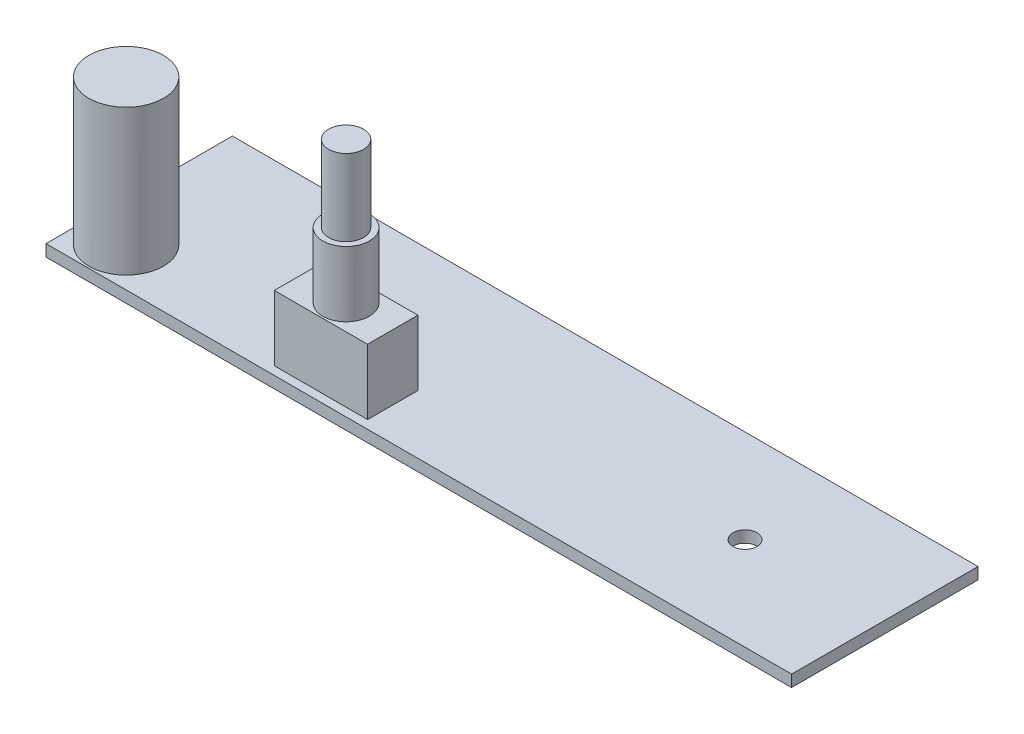
ISO-10303-21;
HEADER;
FILE_DESCRIPTION(('STEP AP214'),'2;1');
FILE_NAME('part.step','',(''),(''),'','','');
FILE_SCHEMA(('AUTOMOTIVE_DESIGN { 1 0 10303 214 1 1 1 1 }'));
ENDSEC;
DATA;
#1=APPLICATION_CONTEXT('core data for automotive mechanical design processes');
#2=APPLICATION_PROTOCOL_DEFINITION('international standard','automotive_design',2000,#1);
#3=PRODUCT_CONTEXT('',#1,'mechanical');
#4=PRODUCT('Part','Part','',(#3));
#5=PRODUCT_RELATED_PRODUCT_CATEGORY('part','',(#4));
#6=PRODUCT_DEFINITION_FORMATION('','',#4);
#7=PRODUCT_DEFINITION_CONTEXT('part definition',#1,'design');
#8=PRODUCT_DEFINITION('design','',#6,#7);
#9=PRODUCT_DEFINITION_SHAPE('','',#8);
#10=(LENGTH_UNIT() NAMED_UNIT(*) SI_UNIT(.MILLI.,.METRE.));
#11=(NAMED_UNIT(*) PLANE_ANGLE_UNIT() SI_UNIT($,.RADIAN.));
#12=(NAMED_UNIT(*) SI_UNIT($,.STERADIAN.) SOLID_ANGLE_UNIT());
#13=UNCERTAINTY_MEASURE_WITH_UNIT(LENGTH_MEASURE(1.E-05),#10,'distance_accuracy_value','');
#14=(GEOMETRIC_REPRESENTATION_CONTEXT(3) GLOBAL_UNCERTAINTY_ASSIGNED_CONTEXT((#13)) GLOBAL_UNIT_ASSIGNED_CONTEXT((#10,
#11,#12)) REPRESENTATION_CONTEXT('',''));
#15=CARTESIAN_POINT('',(0.,0.,0.));
#16=DIRECTION('',(0.,0.,1.));
#17=DIRECTION('',(1.,0.,0.));
#18=AXIS2_PLACEMENT_3D('',#15,#16,#17);
#19=CARTESIAN_POINT('',(0.,1.5875,0.));
#20=DIRECTION('',(0.,-1.,0.));
#21=DIRECTION('',(0.,0.,-1.));
#22=AXIS2_PLACEMENT_3D('',#19,#20,#21);
#23=PLANE('',#22);
#24=DIRECTION('',(0.,0.,1.));
#25=VECTOR('',#24,1.);
#26=CARTESIAN_POINT('',(0.,1.5875,0.));
#27=LINE('',#26,#25);
#28=CARTESIAN_POINT('',(0.,1.5875,-25.4));
#29=VERTEX_POINT('',#28);
#30=CARTESIAN_POINT('',(0.,1.5875,0.));
#31=VERTEX_POINT('',#30);
#32=EDGE_CURVE('E140',#29,#31,#27,.T.);
#33=ORIENTED_EDGE('',*,*,#32,.T.);
#34=DIRECTION('',(1.,0.,0.));
#35=VECTOR('',#34,1.);
#36=CARTESIAN_POINT('',(0.,1.5875,0.));
#37=LINE('',#36,#35);
#38=CARTESIAN_POINT('',(101.6,1.5875,0.));
#39=VERTEX_POINT('',#38);
#40=EDGE_CURVE('E143',#31,#39,#37,.T.);
#41=ORIENTED_EDGE('',*,*,#40,.T.);
#42=DIRECTION('',(0.,0.,-1.));
#43=VECTOR('',#42,1.);
#44=CARTESIAN_POINT('',(101.6,1.5875,0.));
#45=LINE('',#44,#43);
#46=CARTESIAN_POINT('',(101.6,1.5875,-25.4));
#47=VERTEX_POINT('',#46);
#48=EDGE_CURVE('E146',#39,#47,#45,.T.);
#49=ORIENTED_EDGE('',*,*,#48,.T.);
#50=DIRECTION('',(-1.,0.,0.));
#51=VECTOR('',#50,1.);
#52=CARTESIAN_POINT('',(0.,1.5875,-25.4));
#53=LINE('',#52,#51);
#54=EDGE_CURVE('E148',#47,#29,#53,.T.);
#55=ORIENTED_EDGE('',*,*,#54,.T.);
#56=EDGE_LOOP('',(#33,#41,#49,#55));
#57=FACE_BOUND('',#56,.T.);
#58=CARTESIAN_POINT('',(82.55,1.5875,-12.7));
#59=DIRECTION('',(0.,1.,0.));
#60=DIRECTION('',(0.,0.,1.));
#61=AXIS2_PLACEMENT_3D('',#58,#59,#60);
#62=CIRCLE('',#61,1.63194999999999);
#63=CARTESIAN_POINT('',(82.55,1.5875,-11.06805));
#64=VERTEX_POINT('',#63);
#65=EDGE_CURVE('E133',#64,#64,#62,.T.);
#66=ORIENTED_EDGE('',*,*,#65,.F.);
#67=EDGE_LOOP('',(#66));
#68=FACE_BOUND('',#67,.T.);
#69=CARTESIAN_POINT('',(31.75,1.5875,-12.7));
#70=DIRECTION('',(0.,1.,0.));
#71=DIRECTION('',(0.,0.,1.));
#72=AXIS2_PLACEMENT_3D('',#69,#70,#71);
#73=CIRCLE('',#72,1.63194999999999);
#74=CARTESIAN_POINT('',(31.75,1.5875,-11.06805));
#75=VERTEX_POINT('',#74);
#76=EDGE_CURVE('E122',#75,#75,#73,.T.);
#77=ORIENTED_EDGE('',*,*,#76,.F.);
#78=EDGE_LOOP('',(#77));
#79=FACE_BOUND('',#78,.T.);
#80=CARTESIAN_POINT('',(5.588,1.5875,-5.334));
#81=DIRECTION('',(0.,-1.,0.));
#82=DIRECTION('',(0.,0.,-1.));
#83=AXIS2_PLACEMENT_3D('',#80,#81,#82);
#84=CIRCLE('',#83,5.08);
#85=CARTESIAN_POINT('',(5.588,1.5875,-10.414));
#86=VERTEX_POINT('',#85);
#87=EDGE_CURVE('E41',#86,#86,#84,.F.);
#88=ORIENTED_EDGE('',*,*,#87,.F.);
#89=EDGE_LOOP('',(#88));
#90=FACE_BOUND('',#89,.T.);
#91=DIRECTION('',(0.,0.,1.));
#92=VECTOR('',#91,1.);
#93=CARTESIAN_POINT('',(29.972,1.5875,-8.001));
#94=LINE('',#93,#92);
#95=CARTESIAN_POINT('',(29.972,1.5875,-8.001));
#96=VERTEX_POINT('',#95);
#97=CARTESIAN_POINT('',(29.972,1.5875,-1.143));
#98=VERTEX_POINT('',#97);
#99=EDGE_CURVE('E118',#96,#98,#94,.T.);
#100=ORIENTED_EDGE('',*,*,#99,.F.);
#101=DIRECTION('',(-1.,0.,0.));
#102=VECTOR('',#101,1.);
#103=CARTESIAN_POINT('',(42.672,1.5875,-8.001));
#104=LINE('',#103,#102);
#105=CARTESIAN_POINT('',(42.672,1.5875,-8.001));
#106=VERTEX_POINT('',#105);
#107=EDGE_CURVE('E115',#106,#96,#104,.T.);
#108=ORIENTED_EDGE('',*,*,#107,.F.);
#109=DIRECTION('',(0.,0.,-1.));
#110=VECTOR('',#109,1.);
#111=CARTESIAN_POINT('',(42.672,1.5875,-8.001));
#112=LINE('',#111,#110);
#113=CARTESIAN_POINT('',(42.672,1.5875,-1.143));
#114=VERTEX_POINT('',#113);
#115=EDGE_CURVE('E53',#114,#106,#112,.T.);
#116=ORIENTED_EDGE('',*,*,#115,.F.);
#117=DIRECTION('',(1.,0.,0.));
#118=VECTOR('',#117,1.);
#119=CARTESIAN_POINT('',(42.672,1.5875,-1.143));
#120=LINE('',#119,#118);
#121=EDGE_CURVE('E48',#98,#114,#120,.T.);
#122=ORIENTED_EDGE('',*,*,#121,.F.);
#123=EDGE_LOOP('',(#100,#108,#116,#122));
#124=FACE_BOUND('',#123,.T.);
#125=ADVANCED_FACE('F33',(#57,#68,#79,#90,#124),#23,.F.);
#126=CARTESIAN_POINT('',(0.,1.5875,0.));
#127=DIRECTION('',(1.,0.,0.));
#128=DIRECTION('',(0.,0.,-1.));
#129=AXIS2_PLACEMENT_3D('',#126,#127,#128);
#130=PLANE('',#129);
#131=DIRECTION('',(0.,0.,1.));
#132=VECTOR('',#131,1.);
#133=CARTESIAN_POINT('',(0.,0.,0.));
#134=LINE('',#133,#132);
#135=CARTESIAN_POINT('',(0.,0.,-25.4));
#136=VERTEX_POINT('',#135);
#137=CARTESIAN_POINT('',(0.,0.,0.));
#138=VERTEX_POINT('',#137);
#139=EDGE_CURVE('E139',#136,#138,#134,.T.);
#140=ORIENTED_EDGE('',*,*,#139,.T.);
#141=DIRECTION('',(0.,-1.,0.));
#142=VECTOR('',#141,1.);
#143=CARTESIAN_POINT('',(0.,1.5875,0.));
#144=LINE('',#143,#142);
#145=EDGE_CURVE('E166',#31,#138,#144,.T.);
#146=ORIENTED_EDGE('',*,*,#145,.F.);
#147=ORIENTED_EDGE('',*,*,#32,.F.);
#148=DIRECTION('',(0.,-1.,0.));
#149=VECTOR('',#148,1.);
#150=CARTESIAN_POINT('',(0.,1.5875,-25.4));
#151=LINE('',#150,#149);
#152=EDGE_CURVE('E150',#29,#136,#151,.T.);
#153=ORIENTED_EDGE('',*,*,#152,.T.);
#154=EDGE_LOOP('',(#140,#146,#147,#153));
#155=FACE_BOUND('',#154,.T.);
#156=ADVANCED_FACE('F35',(#155),#130,.F.);
#157=CARTESIAN_POINT('',(0.,1.5875,0.));
#158=DIRECTION('',(0.,0.,-1.));
#159=DIRECTION('',(-1.,0.,0.));
#160=AXIS2_PLACEMENT_3D('',#157,#158,#159);
#161=PLANE('',#160);
#162=DIRECTION('',(1.,0.,0.));
#163=VECTOR('',#162,1.);
#164=CARTESIAN_POINT('',(0.,0.,0.));
#165=LINE('',#164,#163);
#166=CARTESIAN_POINT('',(101.6,0.,0.));
#167=VERTEX_POINT('',#166);
#168=EDGE_CURVE('E153',#138,#167,#165,.T.);
#169=ORIENTED_EDGE('',*,*,#168,.T.);
#170=DIRECTION('',(0.,-1.,0.));
#171=VECTOR('',#170,1.);
#172=CARTESIAN_POINT('',(101.6,1.5875,0.));
#173=LINE('',#172,#171);
#174=EDGE_CURVE('E163',#39,#167,#173,.T.);
#175=ORIENTED_EDGE('',*,*,#174,.F.);
#176=ORIENTED_EDGE('',*,*,#40,.F.);
#177=ORIENTED_EDGE('',*,*,#145,.T.);
#178=EDGE_LOOP('',(#169,#175,#176,#177));
#179=FACE_BOUND('',#178,.T.);
#180=ADVANCED_FACE('F260',(#179),#161,.F.);
#181=CARTESIAN_POINT('',(101.6,1.5875,0.));
#182=DIRECTION('',(-1.,0.,0.));
#183=DIRECTION('',(0.,0.,1.));
#184=AXIS2_PLACEMENT_3D('',#181,#182,#183);
#185=PLANE('',#184);
#186=DIRECTION('',(0.,0.,-1.));
#187=VECTOR('',#186,1.);
#188=CARTESIAN_POINT('',(101.6,0.,0.));
#189=LINE('',#188,#187);
#190=CARTESIAN_POINT('',(101.6,0.,-25.4));
#191=VERTEX_POINT('',#190);
#192=EDGE_CURVE('E155',#167,#191,#189,.T.);
#193=ORIENTED_EDGE('',*,*,#192,.T.);
#194=DIRECTION('',(0.,-1.,0.));
#195=VECTOR('',#194,1.);
#196=CARTESIAN_POINT('',(101.6,1.5875,-25.4));
#197=LINE('',#196,#195);
#198=EDGE_CURVE('E160',#47,#191,#197,.T.);
#199=ORIENTED_EDGE('',*,*,#198,.F.);
#200=ORIENTED_EDGE('',*,*,#48,.F.);
#201=ORIENTED_EDGE('',*,*,#174,.T.);
#202=EDGE_LOOP('',(#193,#199,#200,#201));
#203=FACE_BOUND('',#202,.T.);
#204=ADVANCED_FACE('F257',(#203),#185,.F.);
#205=CARTESIAN_POINT('',(0.,1.5875,-25.4));
#206=DIRECTION('',(0.,0.,1.));
#207=DIRECTION('',(1.,0.,0.));
#208=AXIS2_PLACEMENT_3D('',#205,#206,#207);
#209=PLANE('',#208);
#210=DIRECTION('',(-1.,0.,0.));
#211=VECTOR('',#210,1.);
#212=CARTESIAN_POINT('',(0.,0.,-25.4));
#213=LINE('',#212,#211);
#214=EDGE_CURVE('E144',#191,#136,#213,.T.);
#215=ORIENTED_EDGE('',*,*,#214,.T.);
#216=ORIENTED_EDGE('',*,*,#152,.F.);
#217=ORIENTED_EDGE('',*,*,#54,.F.);
#218=ORIENTED_EDGE('',*,*,#198,.T.);
#219=EDGE_LOOP('',(#215,#216,#217,#218));
#220=FACE_BOUND('',#219,.T.);
#221=ADVANCED_FACE('F253',(#220),#209,.F.);
#222=CARTESIAN_POINT('',(0.,0.,0.));
#223=DIRECTION('',(0.,-1.,0.));
#224=DIRECTION('',(0.,0.,-1.));
#225=AXIS2_PLACEMENT_3D('',#222,#223,#224);
#226=PLANE('',#225);
#227=CARTESIAN_POINT('',(31.75,0.,-12.7));
#228=DIRECTION('',(0.,-1.,0.));
#229=DIRECTION('',(0.,0.,-1.));
#230=AXIS2_PLACEMENT_3D('',#227,#228,#229);
#231=CIRCLE('',#230,1.63194999999999);
#232=CARTESIAN_POINT('',(31.75,0.,-14.33195));
#233=VERTEX_POINT('',#232);
#234=EDGE_CURVE('E130',#233,#233,#231,.T.);
#235=ORIENTED_EDGE('',*,*,#234,.F.);
#236=EDGE_LOOP('',(#235));
#237=FACE_BOUND('',#236,.T.);
#238=CARTESIAN_POINT('',(82.55,0.,-12.7));
#239=DIRECTION('',(0.,-1.,0.));
#240=DIRECTION('',(0.,0.,-1.));
#241=AXIS2_PLACEMENT_3D('',#238,#239,#240);
#242=CIRCLE('',#241,1.63194999999999);
#243=CARTESIAN_POINT('',(82.55,0.,-14.33195));
#244=VERTEX_POINT('',#243);
#245=EDGE_CURVE('E136',#244,#244,#242,.T.);
#246=ORIENTED_EDGE('',*,*,#245,.F.);
#247=EDGE_LOOP('',(#246));
#248=FACE_BOUND('',#247,.T.);
#249=ORIENTED_EDGE('',*,*,#139,.F.);
#250=ORIENTED_EDGE('',*,*,#214,.F.);
#251=ORIENTED_EDGE('',*,*,#192,.F.);
#252=ORIENTED_EDGE('',*,*,#168,.F.);
#253=EDGE_LOOP('',(#249,#250,#251,#252));
#254=FACE_BOUND('',#253,.T.);
#255=ADVANCED_FACE('F248',(#237,#248,#254),#226,.T.);
#256=CARTESIAN_POINT('',(82.55,1.5875,-12.7));
#257=DIRECTION('',(0.,1.,0.));
#258=DIRECTION('',(0.,0.,1.));
#259=AXIS2_PLACEMENT_3D('',#256,#257,#258);
#260=CYLINDRICAL_SURFACE('',#259,1.63194999999999);
#261=ORIENTED_EDGE('',*,*,#65,.T.);
#262=EDGE_LOOP('',(#261));
#263=FACE_BOUND('',#262,.T.);
#264=ORIENTED_EDGE('',*,*,#245,.T.);
#265=EDGE_LOOP('',(#264));
#266=FACE_BOUND('',#265,.T.);
#267=ADVANCED_FACE('F245',(#263,#266),#260,.F.);
#268=CARTESIAN_POINT('',(31.75,1.5875,-12.7));
#269=DIRECTION('',(0.,1.,0.));
#270=DIRECTION('',(0.,0.,1.));
#271=AXIS2_PLACEMENT_3D('',#268,#269,#270);
#272=CYLINDRICAL_SURFACE('',#271,1.63194999999999);
#273=ORIENTED_EDGE('',*,*,#76,.T.);
#274=EDGE_LOOP('',(#273));
#275=FACE_BOUND('',#274,.T.);
#276=ORIENTED_EDGE('',*,*,#234,.T.);
#277=EDGE_LOOP('',(#276));
#278=FACE_BOUND('',#277,.T.);
#279=ADVANCED_FACE('F241',(#275,#278),#272,.F.);
#280=CARTESIAN_POINT('',(5.588,21.3995,-5.334));
#281=DIRECTION('',(0.,-1.,0.));
#282=DIRECTION('',(0.,0.,-1.));
#283=AXIS2_PLACEMENT_3D('',#280,#281,#282);
#284=CYLINDRICAL_SURFACE('',#283,5.08);
#285=CARTESIAN_POINT('',(5.588,21.3995,-5.334));
#286=DIRECTION('',(0.,1.,0.));
#287=DIRECTION('',(0.,0.,1.));
#288=AXIS2_PLACEMENT_3D('',#285,#286,#287);
#289=CIRCLE('',#288,5.08);
#290=CARTESIAN_POINT('',(5.588,21.3995,-0.253999999999997));
#291=VERTEX_POINT('',#290);
#292=EDGE_CURVE('E119',#291,#291,#289,.T.);
#293=ORIENTED_EDGE('',*,*,#292,.F.);
#294=EDGE_LOOP('',(#293));
#295=FACE_BOUND('',#294,.T.);
#296=ORIENTED_EDGE('',*,*,#87,.T.);
#297=EDGE_LOOP('',(#296));
#298=FACE_BOUND('',#297,.T.);
#299=ADVANCED_FACE('F171',(#295,#298),#284,.T.);
#300=CARTESIAN_POINT('',(5.588,21.3995,-5.334));
#301=DIRECTION('',(0.,1.,0.));
#302=DIRECTION('',(0.,0.,1.));
#303=AXIS2_PLACEMENT_3D('',#300,#301,#302);
#304=PLANE('',#303);
#305=ORIENTED_EDGE('',*,*,#292,.T.);
#306=EDGE_LOOP('',(#305));
#307=FACE_BOUND('',#306,.T.);
#308=ADVANCED_FACE('F235',(#307),#304,.T.);
#309=CARTESIAN_POINT('',(29.972,10.4775,-8.001));
#310=DIRECTION('',(1.,0.,0.));
#311=DIRECTION('',(0.,0.,-1.));
#312=AXIS2_PLACEMENT_3D('',#309,#310,#311);
#313=PLANE('',#312);
#314=ORIENTED_EDGE('',*,*,#99,.T.);
#315=DIRECTION('',(0.,-1.,0.));
#316=VECTOR('',#315,1.);
#317=CARTESIAN_POINT('',(29.972,10.4775,-1.143));
#318=LINE('',#317,#316);
#319=CARTESIAN_POINT('',(29.972,10.4775,-1.143));
#320=VERTEX_POINT('',#319);
#321=EDGE_CURVE('E99',#320,#98,#318,.T.);
#322=ORIENTED_EDGE('',*,*,#321,.F.);
#323=DIRECTION('',(0.,0.,1.));
#324=VECTOR('',#323,1.);
#325=CARTESIAN_POINT('',(29.972,10.4775,-8.001));
#326=LINE('',#325,#324);
#327=CARTESIAN_POINT('',(29.972,10.4775,-8.001));
#328=VERTEX_POINT('',#327);
#329=EDGE_CURVE('E106',#328,#320,#326,.T.);
#330=ORIENTED_EDGE('',*,*,#329,.F.);
#331=DIRECTION('',(0.,-1.,0.));
#332=VECTOR('',#331,1.);
#333=CARTESIAN_POINT('',(29.972,10.4775,-8.001));
#334=LINE('',#333,#332);
#335=EDGE_CURVE('E182',#328,#96,#334,.T.);
#336=ORIENTED_EDGE('',*,*,#335,.T.);
#337=EDGE_LOOP('',(#314,#322,#330,#336));
#338=FACE_BOUND('',#337,.T.);
#339=ADVANCED_FACE('F117',(#338),#313,.F.);
#340=CARTESIAN_POINT('',(42.672,10.4775,-1.143));
#341=DIRECTION('',(0.,0.,-1.));
#342=DIRECTION('',(-1.,0.,0.));
#343=AXIS2_PLACEMENT_3D('',#340,#341,#342);
#344=PLANE('',#343);
#345=ORIENTED_EDGE('',*,*,#121,.T.);
#346=DIRECTION('',(0.,-1.,0.));
#347=VECTOR('',#346,1.);
#348=CARTESIAN_POINT('',(42.672,10.4775,-1.143));
#349=LINE('',#348,#347);
#350=CARTESIAN_POINT('',(42.672,10.4775,-1.143));
#351=VERTEX_POINT('',#350);
#352=EDGE_CURVE('E102',#351,#114,#349,.T.);
#353=ORIENTED_EDGE('',*,*,#352,.F.);
#354=DIRECTION('',(1.,0.,0.));
#355=VECTOR('',#354,1.);
#356=CARTESIAN_POINT('',(42.672,10.4775,-1.143));
#357=LINE('',#356,#355);
#358=EDGE_CURVE('E95',#320,#351,#357,.T.);
#359=ORIENTED_EDGE('',*,*,#358,.F.);
#360=ORIENTED_EDGE('',*,*,#321,.T.);
#361=EDGE_LOOP('',(#345,#353,#359,#360));
#362=FACE_BOUND('',#361,.T.);
#363=ADVANCED_FACE('F97',(#362),#344,.F.);
#364=CARTESIAN_POINT('',(42.672,10.4775,-8.001));
#365=DIRECTION('',(-1.,0.,0.));
#366=DIRECTION('',(0.,0.,1.));
#367=AXIS2_PLACEMENT_3D('',#364,#365,#366);
#368=PLANE('',#367);
#369=ORIENTED_EDGE('',*,*,#115,.T.);
#370=DIRECTION('',(0.,-1.,0.));
#371=VECTOR('',#370,1.);
#372=CARTESIAN_POINT('',(42.672,10.4775,-8.001));
#373=LINE('',#372,#371);
#374=CARTESIAN_POINT('',(42.672,10.4775,-8.001));
#375=VERTEX_POINT('',#374);
#376=EDGE_CURVE('E124',#375,#106,#373,.T.);
#377=ORIENTED_EDGE('',*,*,#376,.F.);
#378=DIRECTION('',(0.,0.,-1.));
#379=VECTOR('',#378,1.);
#380=CARTESIAN_POINT('',(42.672,10.4775,-8.001));
#381=LINE('',#380,#379);
#382=EDGE_CURVE('E105',#351,#375,#381,.T.);
#383=ORIENTED_EDGE('',*,*,#382,.F.);
#384=ORIENTED_EDGE('',*,*,#352,.T.);
#385=EDGE_LOOP('',(#369,#377,#383,#384));
#386=FACE_BOUND('',#385,.T.);
#387=ADVANCED_FACE('F225',(#386),#368,.F.);
#388=CARTESIAN_POINT('',(42.672,10.4775,-8.001));
#389=DIRECTION('',(0.,0.,1.));
#390=DIRECTION('',(1.,0.,0.));
#391=AXIS2_PLACEMENT_3D('',#388,#389,#390);
#392=PLANE('',#391);
#393=ORIENTED_EDGE('',*,*,#107,.T.);
#394=ORIENTED_EDGE('',*,*,#335,.F.);
#395=DIRECTION('',(-1.,0.,0.));
#396=VECTOR('',#395,1.);
#397=CARTESIAN_POINT('',(42.672,10.4775,-8.001));
#398=LINE('',#397,#396);
#399=EDGE_CURVE('E111',#375,#328,#398,.T.);
#400=ORIENTED_EDGE('',*,*,#399,.F.);
#401=ORIENTED_EDGE('',*,*,#376,.T.);
#402=EDGE_LOOP('',(#393,#394,#400,#401));
#403=FACE_BOUND('',#402,.T.);
#404=ADVANCED_FACE('F181',(#403),#392,.F.);
#405=CARTESIAN_POINT('',(0.,10.4775,0.));
#406=DIRECTION('',(0.,-1.,0.));
#407=DIRECTION('',(0.,0.,-1.));
#408=AXIS2_PLACEMENT_3D('',#405,#406,#407);
#409=PLANE('',#408);
#410=CARTESIAN_POINT('',(36.322,10.4775,-4.572));
#411=DIRECTION('',(0.,-1.,0.));
#412=DIRECTION('',(0.,0.,-1.));
#413=AXIS2_PLACEMENT_3D('',#410,#411,#412);
#414=CIRCLE('',#413,3.175);
#415=CARTESIAN_POINT('',(36.322,10.4775,-7.747));
#416=VERTEX_POINT('',#415);
#417=EDGE_CURVE('E11',#416,#416,#414,.F.);
#418=ORIENTED_EDGE('',*,*,#417,.F.);
#419=EDGE_LOOP('',(#418));
#420=FACE_BOUND('',#419,.T.);
#421=ORIENTED_EDGE('',*,*,#329,.T.);
#422=ORIENTED_EDGE('',*,*,#358,.T.);
#423=ORIENTED_EDGE('',*,*,#382,.T.);
#424=ORIENTED_EDGE('',*,*,#399,.T.);
#425=EDGE_LOOP('',(#421,#422,#423,#424));
#426=FACE_BOUND('',#425,.T.);
#427=ADVANCED_FACE('F109',(#420,#426),#409,.F.);
#428=CARTESIAN_POINT('',(36.322,19.3675,-4.572));
#429=DIRECTION('',(0.,-1.,0.));
#430=DIRECTION('',(0.,0.,-1.));
#431=AXIS2_PLACEMENT_3D('',#428,#429,#430);
#432=CYLINDRICAL_SURFACE('',#431,3.175);
#433=CARTESIAN_POINT('',(36.322,19.3675,-4.572));
#434=DIRECTION('',(0.,1.,0.));
#435=DIRECTION('',(0.,0.,1.));
#436=AXIS2_PLACEMENT_3D('',#433,#434,#435);
#437=CIRCLE('',#436,3.175);
#438=CARTESIAN_POINT('',(36.322,19.3675,-1.397));
#439=VERTEX_POINT('',#438);
#440=EDGE_CURVE('E177',#439,#439,#437,.T.);
#441=ORIENTED_EDGE('',*,*,#440,.F.);
#442=EDGE_LOOP('',(#441));
#443=FACE_BOUND('',#442,.T.);
#444=ORIENTED_EDGE('',*,*,#417,.T.);
#445=EDGE_LOOP('',(#444));
#446=FACE_BOUND('',#445,.T.);
#447=ADVANCED_FACE('F211',(#443,#446),#432,.T.);
#448=CARTESIAN_POINT('',(0.,19.3675,0.));
#449=DIRECTION('',(0.,1.,0.));
#450=DIRECTION('',(0.,0.,1.));
#451=AXIS2_PLACEMENT_3D('',#448,#449,#450);
#452=PLANE('',#451);
#453=CARTESIAN_POINT('',(36.322,19.3675,-4.572));
#454=DIRECTION('',(0.,1.,0.));
#455=DIRECTION('',(0.,0.,1.));
#456=AXIS2_PLACEMENT_3D('',#453,#454,#455);
#457=CIRCLE('',#456,2.38125);
#458=CARTESIAN_POINT('',(36.322,19.3675,-2.19075));
#459=VERTEX_POINT('',#458);
#460=EDGE_CURVE('E194',#459,#459,#457,.T.);
#461=ORIENTED_EDGE('',*,*,#460,.F.);
#462=EDGE_LOOP('',(#461));
#463=FACE_BOUND('',#462,.T.);
#464=ORIENTED_EDGE('',*,*,#440,.T.);
#465=EDGE_LOOP('',(#464));
#466=FACE_BOUND('',#465,.T.);
#467=ADVANCED_FACE('F205',(#463,#466),#452,.T.);
#468=CARTESIAN_POINT('',(36.322,29.7815,-4.572));
#469=DIRECTION('',(0.,-1.,0.));
#470=DIRECTION('',(0.,0.,-1.));
#471=AXIS2_PLACEMENT_3D('',#468,#469,#470);
#472=CYLINDRICAL_SURFACE('',#471,2.38125);
#473=CARTESIAN_POINT('',(36.322,29.7815,-4.572));
#474=DIRECTION('',(0.,1.,0.));
#475=DIRECTION('',(0.,0.,1.));
#476=AXIS2_PLACEMENT_3D('',#473,#474,#475);
#477=CIRCLE('',#476,2.38125);
#478=CARTESIAN_POINT('',(36.322,29.7815,-2.19075));
#479=VERTEX_POINT('',#478);
#480=EDGE_CURVE('E193',#479,#479,#477,.T.);
#481=ORIENTED_EDGE('',*,*,#480,.F.);
#482=EDGE_LOOP('',(#481));
#483=FACE_BOUND('',#482,.T.);
#484=ORIENTED_EDGE('',*,*,#460,.T.);
#485=EDGE_LOOP('',(#484));
#486=FACE_BOUND('',#485,.T.);
#487=ADVANCED_FACE('F202',(#483,#486),#472,.T.);
#488=CARTESIAN_POINT('',(36.322,29.7815,-4.572));
#489=DIRECTION('',(0.,1.,0.));
#490=DIRECTION('',(0.,0.,1.));
#491=AXIS2_PLACEMENT_3D('',#488,#489,#490);
#492=PLANE('',#491);
#493=ORIENTED_EDGE('',*,*,#480,.T.);
#494=EDGE_LOOP('',(#493));
#495=FACE_BOUND('',#494,.T.);
#496=ADVANCED_FACE('F200',(#495),#492,.T.);
#497=CLOSED_SHELL('',(#125,#156,#180,#204,#221,#255,#267,#279,#299,#308,#339,#363,#387,#404,
#427,#447,#467,#487,#496));
#498=MANIFOLD_SOLID_BREP('B2',#497);
#499=ADVANCED_BREP_SHAPE_REPRESENTATION('',(#18,#498),#14);
#500=SHAPE_DEFINITION_REPRESENTATION(#9,#499);
ENDSEC;
END-ISO-10303-21;
